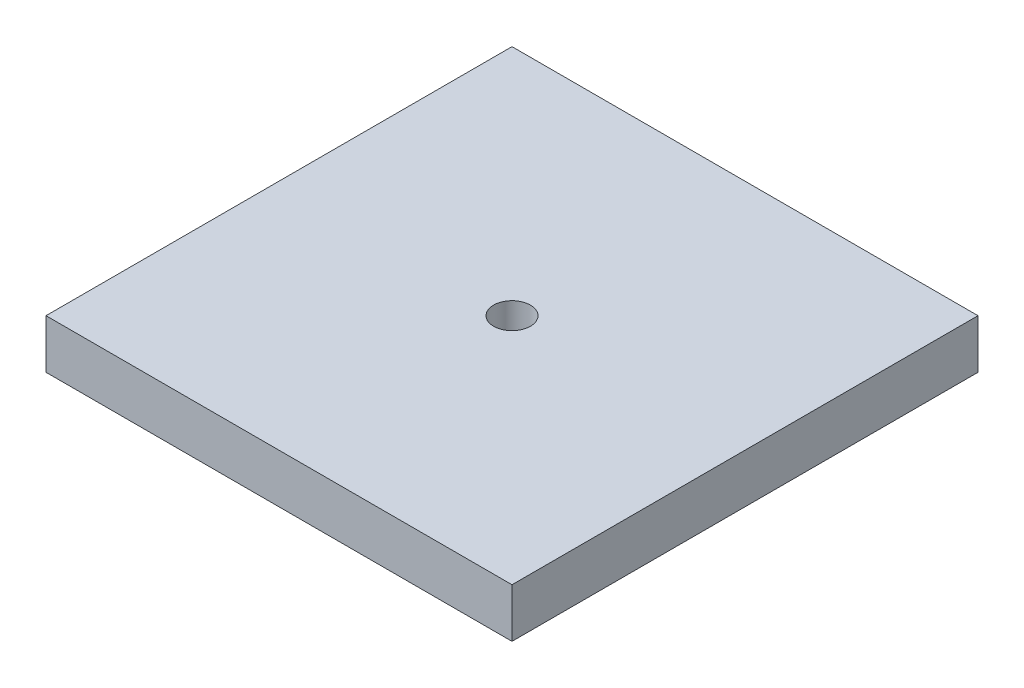
ISO-10303-21;
HEADER;
FILE_DESCRIPTION(('STEP AP214'),'2;1');
FILE_NAME('part.step','',(''),(''),'','','');
FILE_SCHEMA(('AUTOMOTIVE_DESIGN { 1 0 10303 214 1 1 1 1 }'));
ENDSEC;
DATA;
#1=APPLICATION_CONTEXT('core data for automotive mechanical design processes');
#2=APPLICATION_PROTOCOL_DEFINITION('international standard','automotive_design',2000,#1);
#3=PRODUCT_CONTEXT('',#1,'mechanical');
#4=PRODUCT('Part','Part','',(#3));
#5=PRODUCT_RELATED_PRODUCT_CATEGORY('part','',(#4));
#6=PRODUCT_DEFINITION_FORMATION('','',#4);
#7=PRODUCT_DEFINITION_CONTEXT('part definition',#1,'design');
#8=PRODUCT_DEFINITION('design','',#6,#7);
#9=PRODUCT_DEFINITION_SHAPE('','',#8);
#10=(LENGTH_UNIT() NAMED_UNIT(*) SI_UNIT(.MILLI.,.METRE.));
#11=(NAMED_UNIT(*) PLANE_ANGLE_UNIT() SI_UNIT($,.RADIAN.));
#12=(NAMED_UNIT(*) SI_UNIT($,.STERADIAN.) SOLID_ANGLE_UNIT());
#13=UNCERTAINTY_MEASURE_WITH_UNIT(LENGTH_MEASURE(1.E-05),#10,'distance_accuracy_value','');
#14=(GEOMETRIC_REPRESENTATION_CONTEXT(3) GLOBAL_UNCERTAINTY_ASSIGNED_CONTEXT((#13)) GLOBAL_UNIT_ASSIGNED_CONTEXT((#10,
#11,#12)) REPRESENTATION_CONTEXT('',''));
#15=CARTESIAN_POINT('',(0.,0.,0.));
#16=DIRECTION('',(0.,0.,1.));
#17=DIRECTION('',(1.,0.,0.));
#18=AXIS2_PLACEMENT_3D('',#15,#16,#17);
#19=CARTESIAN_POINT('',(0.,1.6,-15.2));
#20=DIRECTION('',(0.,0.,-1.));
#21=DIRECTION('',(-1.,0.,0.));
#22=AXIS2_PLACEMENT_3D('',#19,#20,#21);
#23=PLANE('',#22);
#24=DIRECTION('',(1.,0.,0.));
#25=VECTOR('',#24,1.);
#26=CARTESIAN_POINT('',(0.,0.,-15.2));
#27=LINE('',#26,#25);
#28=CARTESIAN_POINT('',(0.,0.,-15.2));
#29=VERTEX_POINT('',#28);
#30=CARTESIAN_POINT('',(15.2,0.,-15.2));
#31=VERTEX_POINT('',#30);
#32=EDGE_CURVE('E112',#29,#31,#27,.T.);
#33=ORIENTED_EDGE('',*,*,#32,.F.);
#34=DIRECTION('',(0.,-1.,0.));
#35=VECTOR('',#34,1.);
#36=CARTESIAN_POINT('',(0.,1.6,-15.2));
#37=LINE('',#36,#35);
#38=CARTESIAN_POINT('',(0.,1.6,-15.2));
#39=VERTEX_POINT('',#38);
#40=EDGE_CURVE('E11',#39,#29,#37,.T.);
#41=ORIENTED_EDGE('',*,*,#40,.F.);
#42=DIRECTION('',(1.,0.,0.));
#43=VECTOR('',#42,1.);
#44=CARTESIAN_POINT('',(0.,1.6,-15.2));
#45=LINE('',#44,#43);
#46=CARTESIAN_POINT('',(15.2,1.6,-15.2));
#47=VERTEX_POINT('',#46);
#48=EDGE_CURVE('E103',#39,#47,#45,.T.);
#49=ORIENTED_EDGE('',*,*,#48,.T.);
#50=DIRECTION('',(0.,-1.,0.));
#51=VECTOR('',#50,1.);
#52=CARTESIAN_POINT('',(15.2,1.6,-15.2));
#53=LINE('',#52,#51);
#54=EDGE_CURVE('E99',#47,#31,#53,.T.);
#55=ORIENTED_EDGE('',*,*,#54,.T.);
#56=EDGE_LOOP('',(#33,#41,#49,#55));
#57=FACE_BOUND('',#56,.T.);
#58=ADVANCED_FACE('F39',(#57),#23,.T.);
#59=CARTESIAN_POINT('',(0.,1.6,0.));
#60=DIRECTION('',(-1.,0.,0.));
#61=DIRECTION('',(0.,0.,1.));
#62=AXIS2_PLACEMENT_3D('',#59,#60,#61);
#63=PLANE('',#62);
#64=DIRECTION('',(0.,0.,-1.));
#65=VECTOR('',#64,1.);
#66=CARTESIAN_POINT('',(0.,0.,0.));
#67=LINE('',#66,#65);
#68=CARTESIAN_POINT('',(0.,0.,0.));
#69=VERTEX_POINT('',#68);
#70=EDGE_CURVE('E106',#69,#29,#67,.T.);
#71=ORIENTED_EDGE('',*,*,#70,.F.);
#72=DIRECTION('',(0.,-1.,0.));
#73=VECTOR('',#72,1.);
#74=CARTESIAN_POINT('',(0.,1.6,0.));
#75=LINE('',#74,#73);
#76=CARTESIAN_POINT('',(0.,1.6,0.));
#77=VERTEX_POINT('',#76);
#78=EDGE_CURVE('E49',#77,#69,#75,.T.);
#79=ORIENTED_EDGE('',*,*,#78,.F.);
#80=DIRECTION('',(0.,0.,-1.));
#81=VECTOR('',#80,1.);
#82=CARTESIAN_POINT('',(0.,1.6,0.));
#83=LINE('',#82,#81);
#84=EDGE_CURVE('E88',#77,#39,#83,.T.);
#85=ORIENTED_EDGE('',*,*,#84,.T.);
#86=ORIENTED_EDGE('',*,*,#40,.T.);
#87=EDGE_LOOP('',(#71,#79,#85,#86));
#88=FACE_BOUND('',#87,.T.);
#89=ADVANCED_FACE('F128',(#88),#63,.T.);
#90=CARTESIAN_POINT('',(0.,1.6,0.));
#91=DIRECTION('',(0.,0.,-1.));
#92=DIRECTION('',(-1.,0.,0.));
#93=AXIS2_PLACEMENT_3D('',#90,#91,#92);
#94=PLANE('',#93);
#95=DIRECTION('',(1.,0.,0.));
#96=VECTOR('',#95,1.);
#97=CARTESIAN_POINT('',(0.,0.,0.));
#98=LINE('',#97,#96);
#99=CARTESIAN_POINT('',(15.2,0.,0.));
#100=VERTEX_POINT('',#99);
#101=EDGE_CURVE('E94',#69,#100,#98,.T.);
#102=ORIENTED_EDGE('',*,*,#101,.T.);
#103=DIRECTION('',(0.,-1.,0.));
#104=VECTOR('',#103,1.);
#105=CARTESIAN_POINT('',(15.2,1.6,0.));
#106=LINE('',#105,#104);
#107=CARTESIAN_POINT('',(15.2,1.6,0.));
#108=VERTEX_POINT('',#107);
#109=EDGE_CURVE('E92',#108,#100,#106,.T.);
#110=ORIENTED_EDGE('',*,*,#109,.F.);
#111=DIRECTION('',(1.,0.,0.));
#112=VECTOR('',#111,1.);
#113=CARTESIAN_POINT('',(0.,1.6,0.));
#114=LINE('',#113,#112);
#115=EDGE_CURVE('E85',#77,#108,#114,.T.);
#116=ORIENTED_EDGE('',*,*,#115,.F.);
#117=ORIENTED_EDGE('',*,*,#78,.T.);
#118=EDGE_LOOP('',(#102,#110,#116,#117));
#119=FACE_BOUND('',#118,.T.);
#120=ADVANCED_FACE('F93',(#119),#94,.F.);
#121=CARTESIAN_POINT('',(15.2,1.6,0.));
#122=DIRECTION('',(-1.,0.,0.));
#123=DIRECTION('',(0.,0.,1.));
#124=AXIS2_PLACEMENT_3D('',#121,#122,#123);
#125=PLANE('',#124);
#126=DIRECTION('',(0.,0.,-1.));
#127=VECTOR('',#126,1.);
#128=CARTESIAN_POINT('',(15.2,0.,0.));
#129=LINE('',#128,#127);
#130=EDGE_CURVE('E116',#100,#31,#129,.T.);
#131=ORIENTED_EDGE('',*,*,#130,.T.);
#132=ORIENTED_EDGE('',*,*,#54,.F.);
#133=DIRECTION('',(0.,0.,-1.));
#134=VECTOR('',#133,1.);
#135=CARTESIAN_POINT('',(15.2,1.6,0.));
#136=LINE('',#135,#134);
#137=EDGE_CURVE('E82',#108,#47,#136,.T.);
#138=ORIENTED_EDGE('',*,*,#137,.F.);
#139=ORIENTED_EDGE('',*,*,#109,.T.);
#140=EDGE_LOOP('',(#131,#132,#138,#139));
#141=FACE_BOUND('',#140,.T.);
#142=ADVANCED_FACE('F101',(#141),#125,.F.);
#143=CARTESIAN_POINT('',(0.,1.6,0.));
#144=DIRECTION('',(0.,1.,0.));
#145=DIRECTION('',(0.,0.,1.));
#146=AXIS2_PLACEMENT_3D('',#143,#144,#145);
#147=PLANE('',#146);
#148=CARTESIAN_POINT('',(7.6,1.6,-7.6));
#149=DIRECTION('',(0.,1.,0.));
#150=DIRECTION('',(0.,0.,1.));
#151=AXIS2_PLACEMENT_3D('',#148,#149,#150);
#152=CIRCLE('',#151,0.600000000000001);
#153=CARTESIAN_POINT('',(7.6,1.6,-7.));
#154=VERTEX_POINT('',#153);
#155=EDGE_CURVE('E156',#154,#154,#152,.T.);
#156=ORIENTED_EDGE('',*,*,#155,.F.);
#157=EDGE_LOOP('',(#156));
#158=FACE_BOUND('',#157,.T.);
#159=ORIENTED_EDGE('',*,*,#48,.F.);
#160=ORIENTED_EDGE('',*,*,#84,.F.);
#161=ORIENTED_EDGE('',*,*,#115,.T.);
#162=ORIENTED_EDGE('',*,*,#137,.T.);
#163=EDGE_LOOP('',(#159,#160,#161,#162));
#164=FACE_BOUND('',#163,.T.);
#165=ADVANCED_FACE('F87',(#158,#164),#147,.T.);
#166=CARTESIAN_POINT('',(0.,0.,0.));
#167=DIRECTION('',(0.,1.,0.));
#168=DIRECTION('',(0.,0.,1.));
#169=AXIS2_PLACEMENT_3D('',#166,#167,#168);
#170=PLANE('',#169);
#171=CARTESIAN_POINT('',(7.6,0.,-7.6));
#172=DIRECTION('',(0.,1.,0.));
#173=DIRECTION('',(0.,0.,1.));
#174=AXIS2_PLACEMENT_3D('',#171,#172,#173);
#175=CIRCLE('',#174,0.600000000000001);
#176=CARTESIAN_POINT('',(7.6,0.,-7.));
#177=VERTEX_POINT('',#176);
#178=EDGE_CURVE('E42',#177,#177,#175,.T.);
#179=ORIENTED_EDGE('',*,*,#178,.T.);
#180=EDGE_LOOP('',(#179));
#181=FACE_BOUND('',#180,.T.);
#182=ORIENTED_EDGE('',*,*,#32,.T.);
#183=ORIENTED_EDGE('',*,*,#130,.F.);
#184=ORIENTED_EDGE('',*,*,#101,.F.);
#185=ORIENTED_EDGE('',*,*,#70,.T.);
#186=EDGE_LOOP('',(#182,#183,#184,#185));
#187=FACE_BOUND('',#186,.T.);
#188=ADVANCED_FACE('F127',(#181,#187),#170,.F.);
#189=CARTESIAN_POINT('',(7.6,-3.4,-7.6));
#190=DIRECTION('',(0.,1.,0.));
#191=DIRECTION('',(0.,0.,1.));
#192=AXIS2_PLACEMENT_3D('',#189,#190,#191);
#193=CYLINDRICAL_SURFACE('',#192,0.600000000000001);
#194=ORIENTED_EDGE('',*,*,#155,.T.);
#195=EDGE_LOOP('',(#194));
#196=FACE_BOUND('',#195,.T.);
#197=ORIENTED_EDGE('',*,*,#178,.F.);
#198=EDGE_LOOP('',(#197));
#199=FACE_BOUND('',#198,.T.);
#200=ADVANCED_FACE('F146',(#196,#199),#193,.F.);
#201=CLOSED_SHELL('',(#58,#89,#120,#142,#165,#188,#200));
#202=MANIFOLD_SOLID_BREP('B2',#201);
#203=ADVANCED_BREP_SHAPE_REPRESENTATION('',(#18,#202),#14);
#204=SHAPE_DEFINITION_REPRESENTATION(#9,#203);
ENDSEC;
END-ISO-10303-21;
